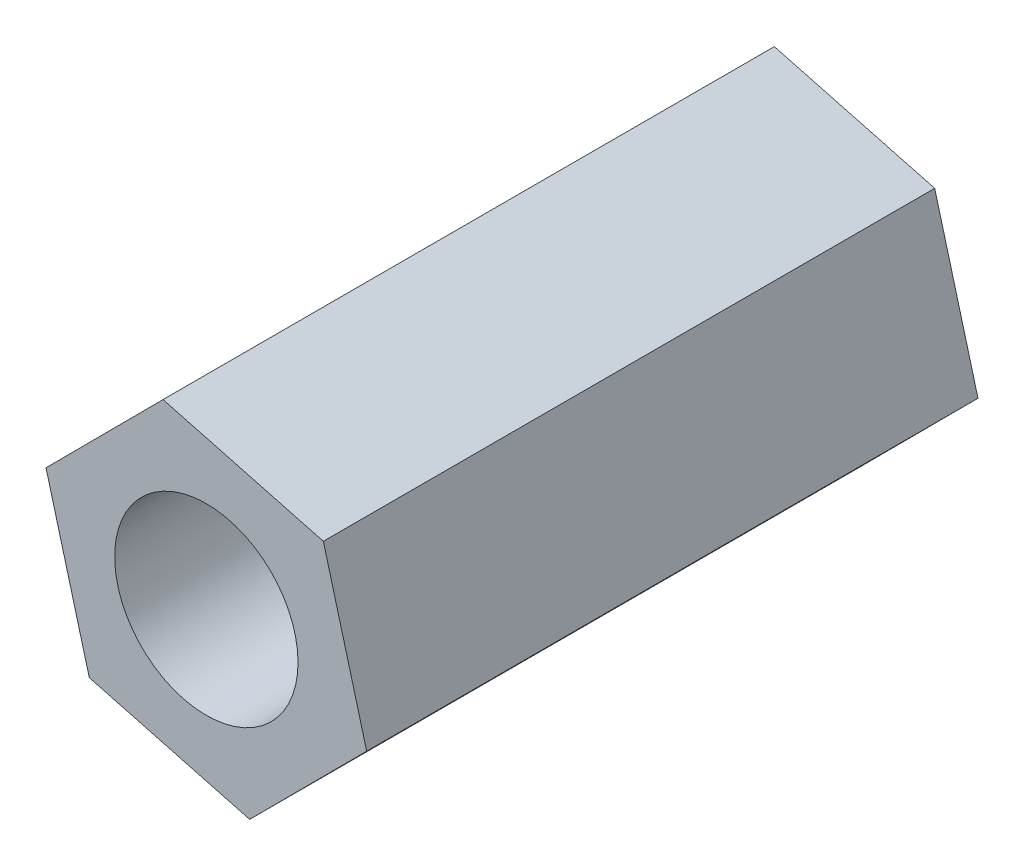
ISO-10303-21;
HEADER;
FILE_DESCRIPTION(('STEP AP214'),'2;1');
FILE_NAME('part.step','',(''),(''),'','','');
FILE_SCHEMA(('AUTOMOTIVE_DESIGN { 1 0 10303 214 1 1 1 1 }'));
ENDSEC;
DATA;
#1=APPLICATION_CONTEXT('core data for automotive mechanical design processes');
#2=APPLICATION_PROTOCOL_DEFINITION('international standard','automotive_design',2000,#1);
#3=PRODUCT_CONTEXT('',#1,'mechanical');
#4=PRODUCT('Part','Part','',(#3));
#5=PRODUCT_RELATED_PRODUCT_CATEGORY('part','',(#4));
#6=PRODUCT_DEFINITION_FORMATION('','',#4);
#7=PRODUCT_DEFINITION_CONTEXT('part definition',#1,'design');
#8=PRODUCT_DEFINITION('design','',#6,#7);
#9=PRODUCT_DEFINITION_SHAPE('','',#8);
#10=(LENGTH_UNIT() NAMED_UNIT(*) SI_UNIT(.MILLI.,.METRE.));
#11=(NAMED_UNIT(*) PLANE_ANGLE_UNIT() SI_UNIT($,.RADIAN.));
#12=(NAMED_UNIT(*) SI_UNIT($,.STERADIAN.) SOLID_ANGLE_UNIT());
#13=UNCERTAINTY_MEASURE_WITH_UNIT(LENGTH_MEASURE(1.E-05),#10,'distance_accuracy_value','');
#14=(GEOMETRIC_REPRESENTATION_CONTEXT(3) GLOBAL_UNCERTAINTY_ASSIGNED_CONTEXT((#13)) GLOBAL_UNIT_ASSIGNED_CONTEXT((#10,
#11,#12)) REPRESENTATION_CONTEXT('',''));
#15=CARTESIAN_POINT('',(0.,0.,0.));
#16=DIRECTION('',(0.,0.,1.));
#17=DIRECTION('',(1.,0.,0.));
#18=AXIS2_PLACEMENT_3D('',#15,#16,#17);
#19=CARTESIAN_POINT('',(0.,0.,10.));
#20=DIRECTION('',(0.,0.,1.));
#21=DIRECTION('',(1.,0.,0.));
#22=AXIS2_PLACEMENT_3D('',#19,#20,#21);
#23=PLANE('',#22);
#24=DIRECTION('',(-0.26109108901012,0.965314168154342,0.));
#25=VECTOR('',#24,1.);
#26=CARTESIAN_POINT('',(2.62272966989177,-0.696148268691921,10.));
#27=LINE('',#26,#25);
#28=CARTESIAN_POINT('',(2.62272966989177,-0.696148268691921,10.));
#29=VERTEX_POINT('',#28);
#30=CARTESIAN_POINT('',(1.91424692043364,1.92327638703948,10.));
#31=VERTEX_POINT('',#30);
#32=EDGE_CURVE('E146',#29,#31,#27,.T.);
#33=ORIENTED_EDGE('',*,*,#32,.T.);
#34=DIRECTION('',(-0.966532136759763,0.256545568292664,0.));
#35=VECTOR('',#34,1.);
#36=CARTESIAN_POINT('',(1.91424692043364,1.92327638703948,10.));
#37=LINE('',#36,#35);
#38=CARTESIAN_POINT('',(-0.708482749458123,2.61942465573141,10.));
#39=VERTEX_POINT('',#38);
#40=EDGE_CURVE('E94',#31,#39,#37,.T.);
#41=ORIENTED_EDGE('',*,*,#40,.T.);
#42=DIRECTION('',(-0.705441047749644,-0.708768599861679,0.));
#43=VECTOR('',#42,1.);
#44=CARTESIAN_POINT('',(-0.708482749458123,2.61942465573141,10.));
#45=LINE('',#44,#43);
#46=CARTESIAN_POINT('',(-2.62272966989177,0.69614826869192,10.));
#47=VERTEX_POINT('',#46);
#48=EDGE_CURVE('E107',#39,#47,#45,.T.);
#49=ORIENTED_EDGE('',*,*,#48,.T.);
#50=DIRECTION('',(0.26109108901012,-0.965314168154342,0.));
#51=VECTOR('',#50,1.);
#52=CARTESIAN_POINT('',(-2.62272966989177,0.69614826869192,10.));
#53=LINE('',#52,#51);
#54=CARTESIAN_POINT('',(-1.91424692043364,-1.92327638703949,10.));
#55=VERTEX_POINT('',#54);
#56=EDGE_CURVE('E101',#47,#55,#53,.T.);
#57=ORIENTED_EDGE('',*,*,#56,.T.);
#58=DIRECTION('',(0.966532136759764,-0.256545568292663,0.));
#59=VECTOR('',#58,1.);
#60=CARTESIAN_POINT('',(-1.91424692043364,-1.92327638703949,10.));
#61=LINE('',#60,#59);
#62=CARTESIAN_POINT('',(0.708482749458124,-2.61942465573141,10.));
#63=VERTEX_POINT('',#62);
#64=EDGE_CURVE('E105',#55,#63,#61,.T.);
#65=ORIENTED_EDGE('',*,*,#64,.T.);
#66=DIRECTION('',(0.705441047749644,0.708768599861679,0.));
#67=VECTOR('',#66,1.);
#68=CARTESIAN_POINT('',(0.708482749458124,-2.61942465573141,10.));
#69=LINE('',#68,#67);
#70=EDGE_CURVE('E57',#63,#29,#69,.T.);
#71=ORIENTED_EDGE('',*,*,#70,.T.);
#72=EDGE_LOOP('',(#33,#41,#49,#57,#65,#71));
#73=FACE_BOUND('',#72,.T.);
#74=CARTESIAN_POINT('',(0.,0.,10.));
#75=DIRECTION('',(0.,0.,1.));
#76=DIRECTION('',(1.,0.,0.));
#77=AXIS2_PLACEMENT_3D('',#74,#75,#76);
#78=CIRCLE('',#77,1.5);
#79=CARTESIAN_POINT('',(1.5,0.,10.));
#80=VERTEX_POINT('',#79);
#81=EDGE_CURVE('E134',#80,#80,#78,.T.);
#82=ORIENTED_EDGE('',*,*,#81,.F.);
#83=EDGE_LOOP('',(#82));
#84=FACE_BOUND('',#83,.T.);
#85=ADVANCED_FACE('F39',(#73,#84),#23,.T.);
#86=CARTESIAN_POINT('',(0.,0.,0.));
#87=DIRECTION('',(0.,0.,1.));
#88=DIRECTION('',(1.,0.,0.));
#89=AXIS2_PLACEMENT_3D('',#86,#87,#88);
#90=PLANE('',#89);
#91=DIRECTION('',(-0.26109108901012,0.965314168154342,0.));
#92=VECTOR('',#91,1.);
#93=CARTESIAN_POINT('',(2.62272966989177,-0.696148268691921,0.));
#94=LINE('',#93,#92);
#95=CARTESIAN_POINT('',(2.62272966989177,-0.696148268691921,0.));
#96=VERTEX_POINT('',#95);
#97=CARTESIAN_POINT('',(1.91424692043364,1.92327638703948,0.));
#98=VERTEX_POINT('',#97);
#99=EDGE_CURVE('E129',#96,#98,#94,.T.);
#100=ORIENTED_EDGE('',*,*,#99,.F.);
#101=DIRECTION('',(0.705441047749644,0.708768599861679,0.));
#102=VECTOR('',#101,1.);
#103=CARTESIAN_POINT('',(0.708482749458124,-2.61942465573141,0.));
#104=LINE('',#103,#102);
#105=CARTESIAN_POINT('',(0.708482749458124,-2.61942465573141,0.));
#106=VERTEX_POINT('',#105);
#107=EDGE_CURVE('E86',#106,#96,#104,.T.);
#108=ORIENTED_EDGE('',*,*,#107,.F.);
#109=DIRECTION('',(0.966532136759764,-0.256545568292663,0.));
#110=VECTOR('',#109,1.);
#111=CARTESIAN_POINT('',(-1.91424692043364,-1.92327638703949,0.));
#112=LINE('',#111,#110);
#113=CARTESIAN_POINT('',(-1.91424692043364,-1.92327638703949,0.));
#114=VERTEX_POINT('',#113);
#115=EDGE_CURVE('E80',#114,#106,#112,.T.);
#116=ORIENTED_EDGE('',*,*,#115,.F.);
#117=DIRECTION('',(0.26109108901012,-0.965314168154342,0.));
#118=VECTOR('',#117,1.);
#119=CARTESIAN_POINT('',(-2.62272966989177,0.69614826869192,0.));
#120=LINE('',#119,#118);
#121=CARTESIAN_POINT('',(-2.62272966989177,0.69614826869192,0.));
#122=VERTEX_POINT('',#121);
#123=EDGE_CURVE('E116',#122,#114,#120,.T.);
#124=ORIENTED_EDGE('',*,*,#123,.F.);
#125=DIRECTION('',(-0.705441047749644,-0.708768599861679,0.));
#126=VECTOR('',#125,1.);
#127=CARTESIAN_POINT('',(-0.708482749458123,2.61942465573141,0.));
#128=LINE('',#127,#126);
#129=CARTESIAN_POINT('',(-0.708482749458123,2.61942465573141,0.));
#130=VERTEX_POINT('',#129);
#131=EDGE_CURVE('E137',#130,#122,#128,.T.);
#132=ORIENTED_EDGE('',*,*,#131,.F.);
#133=DIRECTION('',(-0.966532136759763,0.256545568292664,0.));
#134=VECTOR('',#133,1.);
#135=CARTESIAN_POINT('',(1.91424692043364,1.92327638703948,0.));
#136=LINE('',#135,#134);
#137=EDGE_CURVE('E133',#98,#130,#136,.T.);
#138=ORIENTED_EDGE('',*,*,#137,.F.);
#139=EDGE_LOOP('',(#100,#108,#116,#124,#132,#138));
#140=FACE_BOUND('',#139,.T.);
#141=CARTESIAN_POINT('',(0.,0.,0.));
#142=DIRECTION('',(0.,0.,1.));
#143=DIRECTION('',(1.,0.,0.));
#144=AXIS2_PLACEMENT_3D('',#141,#142,#143);
#145=CIRCLE('',#144,1.5);
#146=CARTESIAN_POINT('',(1.5,0.,0.));
#147=VERTEX_POINT('',#146);
#148=EDGE_CURVE('E243',#147,#147,#145,.T.);
#149=ORIENTED_EDGE('',*,*,#148,.T.);
#150=EDGE_LOOP('',(#149));
#151=FACE_BOUND('',#150,.T.);
#152=ADVANCED_FACE('F159',(#140,#151),#90,.F.);
#153=CARTESIAN_POINT('',(2.62272966989177,-0.696148268691921,10.));
#154=DIRECTION('',(-0.965314168154342,-0.26109108901012,0.));
#155=DIRECTION('',(0.26109108901012,-0.965314168154342,0.));
#156=AXIS2_PLACEMENT_3D('',#153,#154,#155);
#157=PLANE('',#156);
#158=ORIENTED_EDGE('',*,*,#99,.T.);
#159=DIRECTION('',(0.,0.,-1.));
#160=VECTOR('',#159,1.);
#161=CARTESIAN_POINT('',(1.91424692043364,1.92327638703948,10.));
#162=LINE('',#161,#160);
#163=EDGE_CURVE('E11',#31,#98,#162,.T.);
#164=ORIENTED_EDGE('',*,*,#163,.F.);
#165=ORIENTED_EDGE('',*,*,#32,.F.);
#166=DIRECTION('',(0.,0.,-1.));
#167=VECTOR('',#166,1.);
#168=CARTESIAN_POINT('',(2.62272966989177,-0.696148268691921,10.));
#169=LINE('',#168,#167);
#170=EDGE_CURVE('E125',#29,#96,#169,.T.);
#171=ORIENTED_EDGE('',*,*,#170,.T.);
#172=EDGE_LOOP('',(#158,#164,#165,#171));
#173=FACE_BOUND('',#172,.T.);
#174=ADVANCED_FACE('F41',(#173),#157,.F.);
#175=CARTESIAN_POINT('',(1.91424692043364,1.92327638703948,10.));
#176=DIRECTION('',(-0.256545568292664,-0.966532136759764,0.));
#177=DIRECTION('',(0.966532136759764,-0.256545568292664,0.));
#178=AXIS2_PLACEMENT_3D('',#175,#176,#177);
#179=PLANE('',#178);
#180=ORIENTED_EDGE('',*,*,#137,.T.);
#181=DIRECTION('',(0.,0.,-1.));
#182=VECTOR('',#181,1.);
#183=CARTESIAN_POINT('',(-0.708482749458123,2.61942465573141,10.));
#184=LINE('',#183,#182);
#185=EDGE_CURVE('E49',#39,#130,#184,.T.);
#186=ORIENTED_EDGE('',*,*,#185,.F.);
#187=ORIENTED_EDGE('',*,*,#40,.F.);
#188=ORIENTED_EDGE('',*,*,#163,.T.);
#189=EDGE_LOOP('',(#180,#186,#187,#188));
#190=FACE_BOUND('',#189,.T.);
#191=ADVANCED_FACE('F184',(#190),#179,.F.);
#192=CARTESIAN_POINT('',(-0.708482749458123,2.61942465573141,10.));
#193=DIRECTION('',(0.708768599861679,-0.705441047749644,0.));
#194=DIRECTION('',(0.705441047749644,0.708768599861679,0.));
#195=AXIS2_PLACEMENT_3D('',#192,#193,#194);
#196=PLANE('',#195);
#197=ORIENTED_EDGE('',*,*,#131,.T.);
#198=DIRECTION('',(0.,0.,-1.));
#199=VECTOR('',#198,1.);
#200=CARTESIAN_POINT('',(-2.62272966989177,0.69614826869192,10.));
#201=LINE('',#200,#199);
#202=EDGE_CURVE('E118',#47,#122,#201,.T.);
#203=ORIENTED_EDGE('',*,*,#202,.F.);
#204=ORIENTED_EDGE('',*,*,#48,.F.);
#205=ORIENTED_EDGE('',*,*,#185,.T.);
#206=EDGE_LOOP('',(#197,#203,#204,#205));
#207=FACE_BOUND('',#206,.T.);
#208=ADVANCED_FACE('F156',(#207),#196,.F.);
#209=CARTESIAN_POINT('',(-2.62272966989177,0.69614826869192,10.));
#210=DIRECTION('',(0.965314168154342,0.26109108901012,0.));
#211=DIRECTION('',(-0.26109108901012,0.965314168154342,0.));
#212=AXIS2_PLACEMENT_3D('',#209,#210,#211);
#213=PLANE('',#212);
#214=ORIENTED_EDGE('',*,*,#123,.T.);
#215=DIRECTION('',(0.,0.,-1.));
#216=VECTOR('',#215,1.);
#217=CARTESIAN_POINT('',(-1.91424692043364,-1.92327638703949,10.));
#218=LINE('',#217,#216);
#219=EDGE_CURVE('E113',#55,#114,#218,.T.);
#220=ORIENTED_EDGE('',*,*,#219,.F.);
#221=ORIENTED_EDGE('',*,*,#56,.F.);
#222=ORIENTED_EDGE('',*,*,#202,.T.);
#223=EDGE_LOOP('',(#214,#220,#221,#222));
#224=FACE_BOUND('',#223,.T.);
#225=ADVANCED_FACE('F114',(#224),#213,.F.);
#226=CARTESIAN_POINT('',(-1.91424692043364,-1.92327638703949,10.));
#227=DIRECTION('',(0.256545568292663,0.966532136759764,0.));
#228=DIRECTION('',(-0.966532136759764,0.256545568292663,0.));
#229=AXIS2_PLACEMENT_3D('',#226,#227,#228);
#230=PLANE('',#229);
#231=ORIENTED_EDGE('',*,*,#115,.T.);
#232=DIRECTION('',(0.,0.,-1.));
#233=VECTOR('',#232,1.);
#234=CARTESIAN_POINT('',(0.708482749458124,-2.61942465573141,10.));
#235=LINE('',#234,#233);
#236=EDGE_CURVE('E119',#63,#106,#235,.T.);
#237=ORIENTED_EDGE('',*,*,#236,.F.);
#238=ORIENTED_EDGE('',*,*,#64,.F.);
#239=ORIENTED_EDGE('',*,*,#219,.T.);
#240=EDGE_LOOP('',(#231,#237,#238,#239));
#241=FACE_BOUND('',#240,.T.);
#242=ADVANCED_FACE('F121',(#241),#230,.F.);
#243=CARTESIAN_POINT('',(0.708482749458124,-2.61942465573141,10.));
#244=DIRECTION('',(-0.708768599861679,0.705441047749644,0.));
#245=DIRECTION('',(-0.705441047749644,-0.708768599861679,0.));
#246=AXIS2_PLACEMENT_3D('',#243,#244,#245);
#247=PLANE('',#246);
#248=ORIENTED_EDGE('',*,*,#107,.T.);
#249=ORIENTED_EDGE('',*,*,#170,.F.);
#250=ORIENTED_EDGE('',*,*,#70,.F.);
#251=ORIENTED_EDGE('',*,*,#236,.T.);
#252=EDGE_LOOP('',(#248,#249,#250,#251));
#253=FACE_BOUND('',#252,.T.);
#254=ADVANCED_FACE('F164',(#253),#247,.F.);
#255=CARTESIAN_POINT('',(0.,0.,10.));
#256=DIRECTION('',(0.,0.,-1.));
#257=DIRECTION('',(-1.,0.,0.));
#258=AXIS2_PLACEMENT_3D('',#255,#256,#257);
#259=CYLINDRICAL_SURFACE('',#258,1.5);
#260=ORIENTED_EDGE('',*,*,#81,.T.);
#261=EDGE_LOOP('',(#260));
#262=FACE_BOUND('',#261,.T.);
#263=ORIENTED_EDGE('',*,*,#148,.F.);
#264=EDGE_LOOP('',(#263));
#265=FACE_BOUND('',#264,.T.);
#266=ADVANCED_FACE('F166',(#262,#265),#259,.F.);
#267=CLOSED_SHELL('',(#85,#152,#174,#191,#208,#225,#242,#254,#266));
#268=MANIFOLD_SOLID_BREP('B2',#267);
#269=ADVANCED_BREP_SHAPE_REPRESENTATION('',(#18,#268),#14);
#270=SHAPE_DEFINITION_REPRESENTATION(#9,#269);
ENDSEC;
END-ISO-10303-21;
